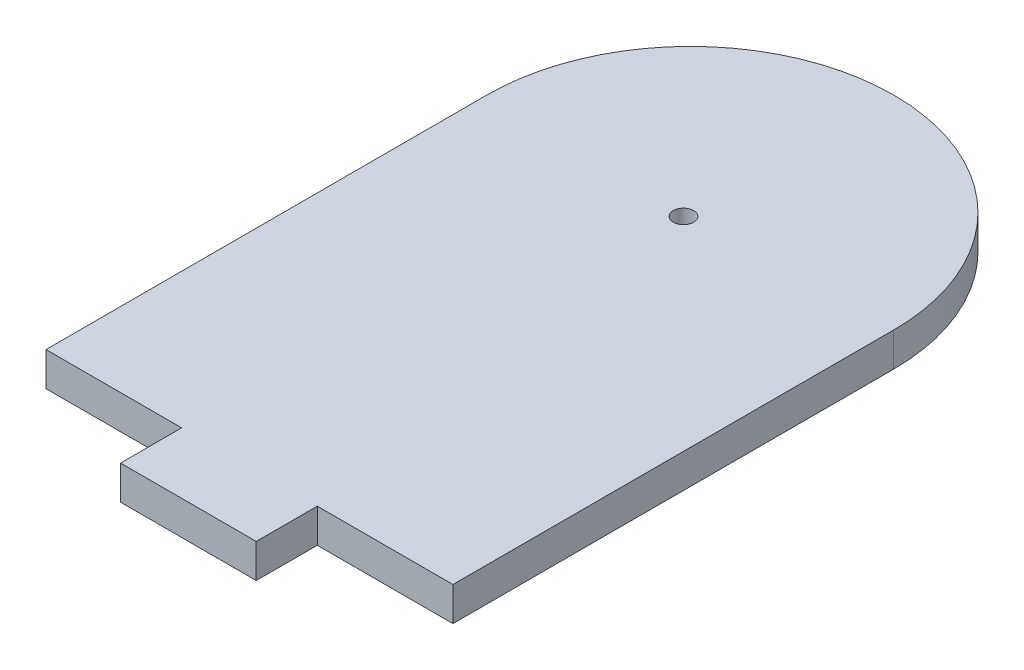
ISO-10303-21;
HEADER;
FILE_DESCRIPTION(('STEP AP214'),'2;1');
FILE_NAME('part.step','',(''),(''),'','','');
FILE_SCHEMA(('AUTOMOTIVE_DESIGN { 1 0 10303 214 1 1 1 1 }'));
ENDSEC;
DATA;
#1=APPLICATION_CONTEXT('core data for automotive mechanical design processes');
#2=APPLICATION_PROTOCOL_DEFINITION('international standard','automotive_design',2000,#1);
#3=PRODUCT_CONTEXT('',#1,'mechanical');
#4=PRODUCT('Part','Part','',(#3));
#5=PRODUCT_RELATED_PRODUCT_CATEGORY('part','',(#4));
#6=PRODUCT_DEFINITION_FORMATION('','',#4);
#7=PRODUCT_DEFINITION_CONTEXT('part definition',#1,'design');
#8=PRODUCT_DEFINITION('design','',#6,#7);
#9=PRODUCT_DEFINITION_SHAPE('','',#8);
#10=(LENGTH_UNIT() NAMED_UNIT(*) SI_UNIT(.MILLI.,.METRE.));
#11=(NAMED_UNIT(*) PLANE_ANGLE_UNIT() SI_UNIT($,.RADIAN.));
#12=(NAMED_UNIT(*) SI_UNIT($,.STERADIAN.) SOLID_ANGLE_UNIT());
#13=UNCERTAINTY_MEASURE_WITH_UNIT(LENGTH_MEASURE(1.E-05),#10,'distance_accuracy_value','');
#14=(GEOMETRIC_REPRESENTATION_CONTEXT(3) GLOBAL_UNCERTAINTY_ASSIGNED_CONTEXT((#13)) GLOBAL_UNIT_ASSIGNED_CONTEXT((#10,
#11,#12)) REPRESENTATION_CONTEXT('',''));
#15=CARTESIAN_POINT('',(0.,0.,0.));
#16=DIRECTION('',(0.,0.,1.));
#17=DIRECTION('',(1.,0.,0.));
#18=AXIS2_PLACEMENT_3D('',#15,#16,#17);
#19=CARTESIAN_POINT('',(0.,5.,32.5));
#20=DIRECTION('',(0.,0.,-1.));
#21=DIRECTION('',(-1.,0.,0.));
#22=AXIS2_PLACEMENT_3D('',#19,#20,#21);
#23=PLANE('',#22);
#24=DIRECTION('',(1.,0.,0.));
#25=VECTOR('',#24,1.);
#26=CARTESIAN_POINT('',(0.,0.,32.5));
#27=LINE('',#26,#25);
#28=CARTESIAN_POINT('',(-30.,0.,32.5));
#29=VERTEX_POINT('',#28);
#30=CARTESIAN_POINT('',(-9.99999999999999,0.,32.5));
#31=VERTEX_POINT('',#30);
#32=EDGE_CURVE('E134',#29,#31,#27,.T.);
#33=ORIENTED_EDGE('',*,*,#32,.T.);
#34=DIRECTION('',(0.,-1.,0.));
#35=VECTOR('',#34,1.);
#36=CARTESIAN_POINT('',(-9.99999999999999,5.,32.5));
#37=LINE('',#36,#35);
#38=CARTESIAN_POINT('',(-9.99999999999999,5.,32.5));
#39=VERTEX_POINT('',#38);
#40=EDGE_CURVE('E11',#39,#31,#37,.T.);
#41=ORIENTED_EDGE('',*,*,#40,.F.);
#42=DIRECTION('',(1.,0.,0.));
#43=VECTOR('',#42,1.);
#44=CARTESIAN_POINT('',(0.,5.,32.5));
#45=LINE('',#44,#43);
#46=CARTESIAN_POINT('',(-30.,5.,32.5));
#47=VERTEX_POINT('',#46);
#48=EDGE_CURVE('E150',#47,#39,#45,.T.);
#49=ORIENTED_EDGE('',*,*,#48,.F.);
#50=DIRECTION('',(0.,-1.,0.));
#51=VECTOR('',#50,1.);
#52=CARTESIAN_POINT('',(-30.,5.,32.5));
#53=LINE('',#52,#51);
#54=EDGE_CURVE('E53',#47,#29,#53,.T.);
#55=ORIENTED_EDGE('',*,*,#54,.T.);
#56=EDGE_LOOP('',(#33,#41,#49,#55));
#57=FACE_BOUND('',#56,.T.);
#58=ADVANCED_FACE('F36',(#57),#23,.F.);
#59=CARTESIAN_POINT('',(-9.99999999999999,5.,0.));
#60=DIRECTION('',(1.,0.,0.));
#61=DIRECTION('',(0.,0.,-1.));
#62=AXIS2_PLACEMENT_3D('',#59,#60,#61);
#63=PLANE('',#62);
#64=DIRECTION('',(0.,0.,1.));
#65=VECTOR('',#64,1.);
#66=CARTESIAN_POINT('',(-9.99999999999999,0.,0.));
#67=LINE('',#66,#65);
#68=CARTESIAN_POINT('',(-9.99999999999999,0.,41.5));
#69=VERTEX_POINT('',#68);
#70=EDGE_CURVE('E136',#31,#69,#67,.T.);
#71=ORIENTED_EDGE('',*,*,#70,.T.);
#72=DIRECTION('',(0.,-1.,0.));
#73=VECTOR('',#72,1.);
#74=CARTESIAN_POINT('',(-9.99999999999999,5.,41.5));
#75=LINE('',#74,#73);
#76=CARTESIAN_POINT('',(-9.99999999999999,5.,41.5));
#77=VERTEX_POINT('',#76);
#78=EDGE_CURVE('E45',#77,#69,#75,.T.);
#79=ORIENTED_EDGE('',*,*,#78,.F.);
#80=DIRECTION('',(0.,0.,1.));
#81=VECTOR('',#80,1.);
#82=CARTESIAN_POINT('',(-9.99999999999999,5.,0.));
#83=LINE('',#82,#81);
#84=EDGE_CURVE('E92',#39,#77,#83,.T.);
#85=ORIENTED_EDGE('',*,*,#84,.F.);
#86=ORIENTED_EDGE('',*,*,#40,.T.);
#87=EDGE_LOOP('',(#71,#79,#85,#86));
#88=FACE_BOUND('',#87,.T.);
#89=ADVANCED_FACE('F38',(#88),#63,.F.);
#90=CARTESIAN_POINT('',(0.,5.,41.5));
#91=DIRECTION('',(0.,0.,-1.));
#92=DIRECTION('',(-1.,0.,0.));
#93=AXIS2_PLACEMENT_3D('',#90,#91,#92);
#94=PLANE('',#93);
#95=DIRECTION('',(1.,0.,0.));
#96=VECTOR('',#95,1.);
#97=CARTESIAN_POINT('',(0.,0.,41.5));
#98=LINE('',#97,#96);
#99=CARTESIAN_POINT('',(10.,0.,41.5));
#100=VERTEX_POINT('',#99);
#101=EDGE_CURVE('E140',#69,#100,#98,.T.);
#102=ORIENTED_EDGE('',*,*,#101,.T.);
#103=DIRECTION('',(0.,-1.,0.));
#104=VECTOR('',#103,1.);
#105=CARTESIAN_POINT('',(10.,5.,41.5));
#106=LINE('',#105,#104);
#107=CARTESIAN_POINT('',(10.,5.,41.5));
#108=VERTEX_POINT('',#107);
#109=EDGE_CURVE('E157',#108,#100,#106,.T.);
#110=ORIENTED_EDGE('',*,*,#109,.F.);
#111=DIRECTION('',(1.,0.,0.));
#112=VECTOR('',#111,1.);
#113=CARTESIAN_POINT('',(0.,5.,41.5));
#114=LINE('',#113,#112);
#115=EDGE_CURVE('E165',#77,#108,#114,.T.);
#116=ORIENTED_EDGE('',*,*,#115,.F.);
#117=ORIENTED_EDGE('',*,*,#78,.T.);
#118=EDGE_LOOP('',(#102,#110,#116,#117));
#119=FACE_BOUND('',#118,.T.);
#120=ADVANCED_FACE('F163',(#119),#94,.F.);
#121=CARTESIAN_POINT('',(10.,5.,0.));
#122=DIRECTION('',(-1.,0.,0.));
#123=DIRECTION('',(0.,0.,1.));
#124=AXIS2_PLACEMENT_3D('',#121,#122,#123);
#125=PLANE('',#124);
#126=DIRECTION('',(0.,0.,-1.));
#127=VECTOR('',#126,1.);
#128=CARTESIAN_POINT('',(10.,0.,0.));
#129=LINE('',#128,#127);
#130=CARTESIAN_POINT('',(10.,0.,32.5));
#131=VERTEX_POINT('',#130);
#132=EDGE_CURVE('E142',#100,#131,#129,.T.);
#133=ORIENTED_EDGE('',*,*,#132,.T.);
#134=DIRECTION('',(0.,-1.,0.));
#135=VECTOR('',#134,1.);
#136=CARTESIAN_POINT('',(10.,5.,32.5));
#137=LINE('',#136,#135);
#138=CARTESIAN_POINT('',(10.,5.,32.5));
#139=VERTEX_POINT('',#138);
#140=EDGE_CURVE('E154',#139,#131,#137,.T.);
#141=ORIENTED_EDGE('',*,*,#140,.F.);
#142=DIRECTION('',(0.,0.,-1.));
#143=VECTOR('',#142,1.);
#144=CARTESIAN_POINT('',(10.,5.,0.));
#145=LINE('',#144,#143);
#146=EDGE_CURVE('E176',#108,#139,#145,.T.);
#147=ORIENTED_EDGE('',*,*,#146,.F.);
#148=ORIENTED_EDGE('',*,*,#109,.T.);
#149=EDGE_LOOP('',(#133,#141,#147,#148));
#150=FACE_BOUND('',#149,.T.);
#151=ADVANCED_FACE('F172',(#150),#125,.F.);
#152=CARTESIAN_POINT('',(30.,0.,32.5));
#153=VERTEX_POINT('',#152);
#154=EDGE_CURVE('E138',#131,#153,#27,.T.);
#155=ORIENTED_EDGE('',*,*,#154,.T.);
#156=DIRECTION('',(0.,-1.,0.));
#157=VECTOR('',#156,1.);
#158=CARTESIAN_POINT('',(30.,5.,32.5));
#159=LINE('',#158,#157);
#160=CARTESIAN_POINT('',(30.,5.,32.5));
#161=VERTEX_POINT('',#160);
#162=EDGE_CURVE('E126',#161,#153,#159,.T.);
#163=ORIENTED_EDGE('',*,*,#162,.F.);
#164=EDGE_CURVE('E114',#139,#161,#45,.T.);
#165=ORIENTED_EDGE('',*,*,#164,.F.);
#166=ORIENTED_EDGE('',*,*,#140,.T.);
#167=EDGE_LOOP('',(#155,#163,#165,#166));
#168=FACE_BOUND('',#167,.T.);
#169=ADVANCED_FACE('F175',(#168),#23,.F.);
#170=CARTESIAN_POINT('',(30.,5.,0.));
#171=DIRECTION('',(-1.,0.,0.));
#172=DIRECTION('',(0.,0.,1.));
#173=AXIS2_PLACEMENT_3D('',#170,#171,#172);
#174=PLANE('',#173);
#175=DIRECTION('',(0.,0.,-1.));
#176=VECTOR('',#175,1.);
#177=CARTESIAN_POINT('',(30.,0.,0.));
#178=LINE('',#177,#176);
#179=CARTESIAN_POINT('',(30.,0.,-32.5));
#180=VERTEX_POINT('',#179);
#181=EDGE_CURVE('E123',#153,#180,#178,.T.);
#182=ORIENTED_EDGE('',*,*,#181,.T.);
#183=DIRECTION('',(0.,-1.,0.));
#184=VECTOR('',#183,1.);
#185=CARTESIAN_POINT('',(30.,5.,-32.5));
#186=LINE('',#185,#184);
#187=CARTESIAN_POINT('',(30.,5.,-32.5));
#188=VERTEX_POINT('',#187);
#189=EDGE_CURVE('E120',#188,#180,#186,.T.);
#190=ORIENTED_EDGE('',*,*,#189,.F.);
#191=DIRECTION('',(0.,0.,-1.));
#192=VECTOR('',#191,1.);
#193=CARTESIAN_POINT('',(30.,5.,0.));
#194=LINE('',#193,#192);
#195=EDGE_CURVE('E107',#161,#188,#194,.T.);
#196=ORIENTED_EDGE('',*,*,#195,.F.);
#197=ORIENTED_EDGE('',*,*,#162,.T.);
#198=EDGE_LOOP('',(#182,#190,#196,#197));
#199=FACE_BOUND('',#198,.T.);
#200=ADVANCED_FACE('F121',(#199),#174,.F.);
#201=CARTESIAN_POINT('',(0.,5.,-32.5));
#202=DIRECTION('',(0.,-1.,0.));
#203=DIRECTION('',(0.,0.,-1.));
#204=AXIS2_PLACEMENT_3D('',#201,#202,#203);
#205=CYLINDRICAL_SURFACE('',#204,30.);
#206=CARTESIAN_POINT('',(0.,0.,-32.5));
#207=DIRECTION('',(0.,1.,0.));
#208=DIRECTION('',(0.,0.,1.));
#209=AXIS2_PLACEMENT_3D('',#206,#207,#208);
#210=CIRCLE('',#209,30.);
#211=CARTESIAN_POINT('',(-30.,0.,-32.5));
#212=VERTEX_POINT('',#211);
#213=EDGE_CURVE('E145',#180,#212,#210,.T.);
#214=ORIENTED_EDGE('',*,*,#213,.T.);
#215=DIRECTION('',(0.,-1.,0.));
#216=VECTOR('',#215,1.);
#217=CARTESIAN_POINT('',(-30.,5.,-32.5));
#218=LINE('',#217,#216);
#219=CARTESIAN_POINT('',(-30.,5.,-32.5));
#220=VERTEX_POINT('',#219);
#221=EDGE_CURVE('E80',#220,#212,#218,.T.);
#222=ORIENTED_EDGE('',*,*,#221,.F.);
#223=CARTESIAN_POINT('',(0.,5.,-32.5));
#224=DIRECTION('',(0.,1.,0.));
#225=DIRECTION('',(0.,0.,1.));
#226=AXIS2_PLACEMENT_3D('',#223,#224,#225);
#227=CIRCLE('',#226,30.);
#228=EDGE_CURVE('E112',#188,#220,#227,.T.);
#229=ORIENTED_EDGE('',*,*,#228,.F.);
#230=ORIENTED_EDGE('',*,*,#189,.T.);
#231=EDGE_LOOP('',(#214,#222,#229,#230));
#232=FACE_BOUND('',#231,.T.);
#233=ADVANCED_FACE('F128',(#232),#205,.T.);
#234=CARTESIAN_POINT('',(-30.,5.,0.));
#235=DIRECTION('',(-1.,0.,0.));
#236=DIRECTION('',(0.,0.,1.));
#237=AXIS2_PLACEMENT_3D('',#234,#235,#236);
#238=PLANE('',#237);
#239=DIRECTION('',(0.,0.,-1.));
#240=VECTOR('',#239,1.);
#241=CARTESIAN_POINT('',(-30.,0.,0.));
#242=LINE('',#241,#240);
#243=EDGE_CURVE('E147',#29,#212,#242,.T.);
#244=ORIENTED_EDGE('',*,*,#243,.F.);
#245=ORIENTED_EDGE('',*,*,#54,.F.);
#246=DIRECTION('',(0.,0.,-1.));
#247=VECTOR('',#246,1.);
#248=CARTESIAN_POINT('',(-30.,5.,0.));
#249=LINE('',#248,#247);
#250=EDGE_CURVE('E129',#47,#220,#249,.T.);
#251=ORIENTED_EDGE('',*,*,#250,.T.);
#252=ORIENTED_EDGE('',*,*,#221,.T.);
#253=EDGE_LOOP('',(#244,#245,#251,#252));
#254=FACE_BOUND('',#253,.T.);
#255=ADVANCED_FACE('F238',(#254),#238,.T.);
#256=CARTESIAN_POINT('',(0.,5.,0.));
#257=DIRECTION('',(0.,1.,0.));
#258=DIRECTION('',(0.,0.,1.));
#259=AXIS2_PLACEMENT_3D('',#256,#257,#258);
#260=PLANE('',#259);
#261=CARTESIAN_POINT('',(0.,5.,-31.5));
#262=DIRECTION('',(0.,1.,0.));
#263=DIRECTION('',(0.,0.,1.));
#264=AXIS2_PLACEMENT_3D('',#261,#262,#263);
#265=CIRCLE('',#264,1.5);
#266=CARTESIAN_POINT('',(0.,5.,-30.));
#267=VERTEX_POINT('',#266);
#268=EDGE_CURVE('E292',#267,#267,#265,.T.);
#269=ORIENTED_EDGE('',*,*,#268,.F.);
#270=EDGE_LOOP('',(#269));
#271=FACE_BOUND('',#270,.T.);
#272=ORIENTED_EDGE('',*,*,#48,.T.);
#273=ORIENTED_EDGE('',*,*,#84,.T.);
#274=ORIENTED_EDGE('',*,*,#115,.T.);
#275=ORIENTED_EDGE('',*,*,#146,.T.);
#276=ORIENTED_EDGE('',*,*,#164,.T.);
#277=ORIENTED_EDGE('',*,*,#195,.T.);
#278=ORIENTED_EDGE('',*,*,#228,.T.);
#279=ORIENTED_EDGE('',*,*,#250,.F.);
#280=EDGE_LOOP('',(#272,#273,#274,#275,#276,#277,#278,#279));
#281=FACE_BOUND('',#280,.T.);
#282=ADVANCED_FACE('F109',(#271,#281),#260,.T.);
#283=CARTESIAN_POINT('',(0.,0.,0.));
#284=DIRECTION('',(0.,1.,0.));
#285=DIRECTION('',(0.,0.,1.));
#286=AXIS2_PLACEMENT_3D('',#283,#284,#285);
#287=PLANE('',#286);
#288=CARTESIAN_POINT('',(0.,0.,-31.5));
#289=DIRECTION('',(0.,1.,0.));
#290=DIRECTION('',(0.,0.,1.));
#291=AXIS2_PLACEMENT_3D('',#288,#289,#290);
#292=CIRCLE('',#291,1.5);
#293=CARTESIAN_POINT('',(0.,0.,-30.));
#294=VERTEX_POINT('',#293);
#295=EDGE_CURVE('E137',#294,#294,#292,.T.);
#296=ORIENTED_EDGE('',*,*,#295,.T.);
#297=EDGE_LOOP('',(#296));
#298=FACE_BOUND('',#297,.T.);
#299=ORIENTED_EDGE('',*,*,#32,.F.);
#300=ORIENTED_EDGE('',*,*,#243,.T.);
#301=ORIENTED_EDGE('',*,*,#213,.F.);
#302=ORIENTED_EDGE('',*,*,#181,.F.);
#303=ORIENTED_EDGE('',*,*,#154,.F.);
#304=ORIENTED_EDGE('',*,*,#132,.F.);
#305=ORIENTED_EDGE('',*,*,#101,.F.);
#306=ORIENTED_EDGE('',*,*,#70,.F.);
#307=EDGE_LOOP('',(#299,#300,#301,#302,#303,#304,#305,#306));
#308=FACE_BOUND('',#307,.T.);
#309=ADVANCED_FACE('F168',(#298,#308),#287,.F.);
#310=CARTESIAN_POINT('',(0.,0.,-31.5));
#311=DIRECTION('',(0.,1.,0.));
#312=DIRECTION('',(0.,0.,1.));
#313=AXIS2_PLACEMENT_3D('',#310,#311,#312);
#314=CYLINDRICAL_SURFACE('',#313,1.5);
#315=ORIENTED_EDGE('',*,*,#295,.F.);
#316=EDGE_LOOP('',(#315));
#317=FACE_BOUND('',#316,.T.);
#318=ORIENTED_EDGE('',*,*,#268,.T.);
#319=EDGE_LOOP('',(#318));
#320=FACE_BOUND('',#319,.T.);
#321=ADVANCED_FACE('F267',(#317,#320),#314,.F.);
#322=CLOSED_SHELL('',(#58,#89,#120,#151,#169,#200,#233,#255,#282,#309,#321));
#323=MANIFOLD_SOLID_BREP('B2',#322);
#324=ADVANCED_BREP_SHAPE_REPRESENTATION('',(#18,#323),#14);
#325=SHAPE_DEFINITION_REPRESENTATION(#9,#324);
ENDSEC;
END-ISO-10303-21;
